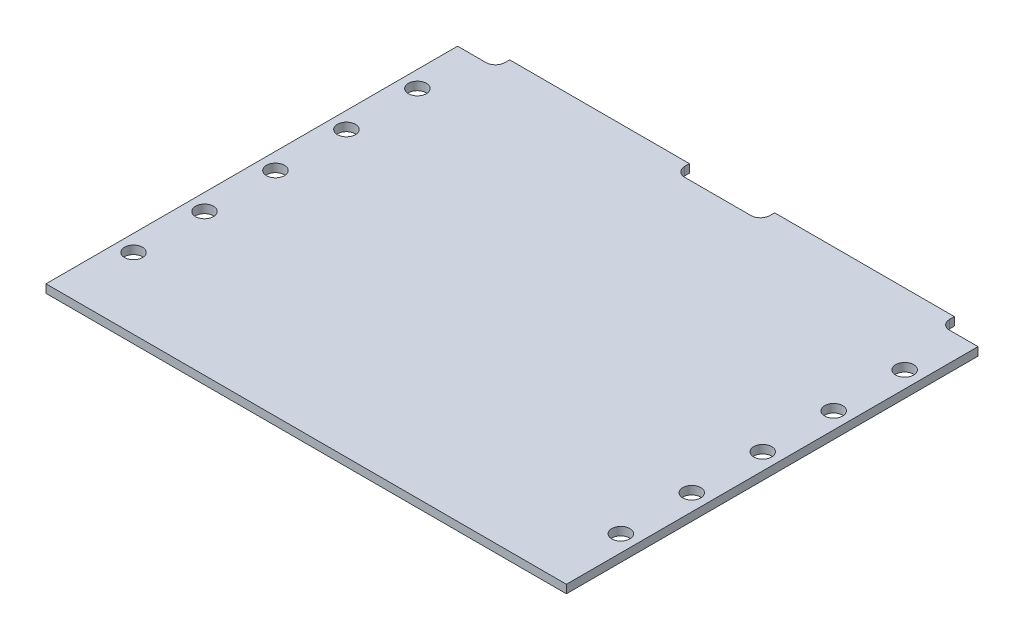
ISO-10303-21;
HEADER;
FILE_DESCRIPTION(('STEP AP214'),'2;1');
FILE_NAME('part.step','',(''),(''),'','','');
FILE_SCHEMA(('AUTOMOTIVE_DESIGN { 1 0 10303 214 1 1 1 1 }'));
ENDSEC;
DATA;
#1=APPLICATION_CONTEXT('core data for automotive mechanical design processes');
#2=APPLICATION_PROTOCOL_DEFINITION('international standard','automotive_design',2000,#1);
#3=PRODUCT_CONTEXT('',#1,'mechanical');
#4=PRODUCT('Part','Part','',(#3));
#5=PRODUCT_RELATED_PRODUCT_CATEGORY('part','',(#4));
#6=PRODUCT_DEFINITION_FORMATION('','',#4);
#7=PRODUCT_DEFINITION_CONTEXT('part definition',#1,'design');
#8=PRODUCT_DEFINITION('design','',#6,#7);
#9=PRODUCT_DEFINITION_SHAPE('','',#8);
#10=(LENGTH_UNIT() NAMED_UNIT(*) SI_UNIT(.MILLI.,.METRE.));
#11=(NAMED_UNIT(*) PLANE_ANGLE_UNIT() SI_UNIT($,.RADIAN.));
#12=(NAMED_UNIT(*) SI_UNIT($,.STERADIAN.) SOLID_ANGLE_UNIT());
#13=UNCERTAINTY_MEASURE_WITH_UNIT(LENGTH_MEASURE(1.E-05),#10,'distance_accuracy_value','');
#14=(GEOMETRIC_REPRESENTATION_CONTEXT(3) GLOBAL_UNCERTAINTY_ASSIGNED_CONTEXT((#13)) GLOBAL_UNIT_ASSIGNED_CONTEXT((#10,
#11,#12)) REPRESENTATION_CONTEXT('',''));
#15=CARTESIAN_POINT('',(0.,0.,0.));
#16=DIRECTION('',(0.,0.,1.));
#17=DIRECTION('',(1.,0.,0.));
#18=AXIS2_PLACEMENT_3D('',#15,#16,#17);
#19=CARTESIAN_POINT('',(0.,1.7526,-87.));
#20=DIRECTION('',(0.,0.,1.));
#21=DIRECTION('',(1.,0.,0.));
#22=AXIS2_PLACEMENT_3D('',#19,#20,#21);
#23=PLANE('',#22);
#24=DIRECTION('',(-1.,0.,0.));
#25=VECTOR('',#24,1.);
#26=CARTESIAN_POINT('',(0.,0.,-87.));
#27=LINE('',#26,#25);
#28=CARTESIAN_POINT('',(5.99999999999999,0.,-87.));
#29=VERTEX_POINT('',#28);
#30=CARTESIAN_POINT('',(0.,0.,-87.));
#31=VERTEX_POINT('',#30);
#32=EDGE_CURVE('E176',#29,#31,#27,.T.);
#33=ORIENTED_EDGE('',*,*,#32,.T.);
#34=DIRECTION('',(0.,-1.,0.));
#35=VECTOR('',#34,1.);
#36=CARTESIAN_POINT('',(0.,1.7526,-87.));
#37=LINE('',#36,#35);
#38=CARTESIAN_POINT('',(0.,1.7526,-87.));
#39=VERTEX_POINT('',#38);
#40=EDGE_CURVE('E11',#39,#31,#37,.T.);
#41=ORIENTED_EDGE('',*,*,#40,.F.);
#42=DIRECTION('',(-1.,0.,0.));
#43=VECTOR('',#42,1.);
#44=CARTESIAN_POINT('',(0.,1.7526,-87.));
#45=LINE('',#44,#43);
#46=CARTESIAN_POINT('',(5.99999999999999,1.7526,-87.));
#47=VERTEX_POINT('',#46);
#48=EDGE_CURVE('E207',#47,#39,#45,.T.);
#49=ORIENTED_EDGE('',*,*,#48,.F.);
#50=DIRECTION('',(0.,-1.,0.));
#51=VECTOR('',#50,1.);
#52=CARTESIAN_POINT('',(5.99999999999999,1.7526,-87.));
#53=LINE('',#52,#51);
#54=EDGE_CURVE('E172',#47,#29,#53,.T.);
#55=ORIENTED_EDGE('',*,*,#54,.T.);
#56=EDGE_LOOP('',(#33,#41,#49,#55));
#57=FACE_BOUND('',#56,.T.);
#58=ADVANCED_FACE('F32',(#57),#23,.F.);
#59=CARTESIAN_POINT('',(0.,1.7526,0.));
#60=DIRECTION('',(1.,0.,0.));
#61=DIRECTION('',(0.,0.,-1.));
#62=AXIS2_PLACEMENT_3D('',#59,#60,#61);
#63=PLANE('',#62);
#64=DIRECTION('',(0.,0.,1.));
#65=VECTOR('',#64,1.);
#66=CARTESIAN_POINT('',(0.,0.,0.));
#67=LINE('',#66,#65);
#68=CARTESIAN_POINT('',(0.,0.,0.));
#69=VERTEX_POINT('',#68);
#70=EDGE_CURVE('E179',#31,#69,#67,.T.);
#71=ORIENTED_EDGE('',*,*,#70,.T.);
#72=DIRECTION('',(0.,-1.,0.));
#73=VECTOR('',#72,1.);
#74=CARTESIAN_POINT('',(0.,1.7526,0.));
#75=LINE('',#74,#73);
#76=CARTESIAN_POINT('',(0.,1.7526,0.));
#77=VERTEX_POINT('',#76);
#78=EDGE_CURVE('E40',#77,#69,#75,.T.);
#79=ORIENTED_EDGE('',*,*,#78,.F.);
#80=DIRECTION('',(0.,0.,1.));
#81=VECTOR('',#80,1.);
#82=CARTESIAN_POINT('',(0.,1.7526,0.));
#83=LINE('',#82,#81);
#84=EDGE_CURVE('E115',#39,#77,#83,.T.);
#85=ORIENTED_EDGE('',*,*,#84,.F.);
#86=ORIENTED_EDGE('',*,*,#40,.T.);
#87=EDGE_LOOP('',(#71,#79,#85,#86));
#88=FACE_BOUND('',#87,.T.);
#89=ADVANCED_FACE('F306',(#88),#63,.F.);
#90=CARTESIAN_POINT('',(0.,1.7526,0.));
#91=DIRECTION('',(0.,0.,-1.));
#92=DIRECTION('',(-1.,0.,0.));
#93=AXIS2_PLACEMENT_3D('',#90,#91,#92);
#94=PLANE('',#93);
#95=DIRECTION('',(1.,0.,0.));
#96=VECTOR('',#95,1.);
#97=CARTESIAN_POINT('',(0.,0.,0.));
#98=LINE('',#97,#96);
#99=CARTESIAN_POINT('',(110.,0.,0.));
#100=VERTEX_POINT('',#99);
#101=EDGE_CURVE('E182',#69,#100,#98,.T.);
#102=ORIENTED_EDGE('',*,*,#101,.T.);
#103=DIRECTION('',(0.,-1.,0.));
#104=VECTOR('',#103,1.);
#105=CARTESIAN_POINT('',(110.,1.7526,0.));
#106=LINE('',#105,#104);
#107=CARTESIAN_POINT('',(110.,1.7526,0.));
#108=VERTEX_POINT('',#107);
#109=EDGE_CURVE('E238',#108,#100,#106,.T.);
#110=ORIENTED_EDGE('',*,*,#109,.F.);
#111=DIRECTION('',(1.,0.,0.));
#112=VECTOR('',#111,1.);
#113=CARTESIAN_POINT('',(0.,1.7526,0.));
#114=LINE('',#113,#112);
#115=EDGE_CURVE('E246',#77,#108,#114,.T.);
#116=ORIENTED_EDGE('',*,*,#115,.F.);
#117=ORIENTED_EDGE('',*,*,#78,.T.);
#118=EDGE_LOOP('',(#102,#110,#116,#117));
#119=FACE_BOUND('',#118,.T.);
#120=ADVANCED_FACE('F244',(#119),#94,.F.);
#121=CARTESIAN_POINT('',(110.,1.7526,0.));
#122=DIRECTION('',(-1.,0.,0.));
#123=DIRECTION('',(0.,0.,1.));
#124=AXIS2_PLACEMENT_3D('',#121,#122,#123);
#125=PLANE('',#124);
#126=DIRECTION('',(0.,0.,-1.));
#127=VECTOR('',#126,1.);
#128=CARTESIAN_POINT('',(110.,0.,0.));
#129=LINE('',#128,#127);
#130=CARTESIAN_POINT('',(110.,0.,-87.));
#131=VERTEX_POINT('',#130);
#132=EDGE_CURVE('E184',#100,#131,#129,.T.);
#133=ORIENTED_EDGE('',*,*,#132,.T.);
#134=DIRECTION('',(0.,-1.,0.));
#135=VECTOR('',#134,1.);
#136=CARTESIAN_POINT('',(110.,1.7526,-87.));
#137=LINE('',#136,#135);
#138=CARTESIAN_POINT('',(110.,1.7526,-87.));
#139=VERTEX_POINT('',#138);
#140=EDGE_CURVE('E235',#139,#131,#137,.T.);
#141=ORIENTED_EDGE('',*,*,#140,.F.);
#142=DIRECTION('',(0.,0.,-1.));
#143=VECTOR('',#142,1.);
#144=CARTESIAN_POINT('',(110.,1.7526,0.));
#145=LINE('',#144,#143);
#146=EDGE_CURVE('E264',#108,#139,#145,.T.);
#147=ORIENTED_EDGE('',*,*,#146,.F.);
#148=ORIENTED_EDGE('',*,*,#109,.T.);
#149=EDGE_LOOP('',(#133,#141,#147,#148));
#150=FACE_BOUND('',#149,.T.);
#151=ADVANCED_FACE('F255',(#150),#125,.F.);
#152=CARTESIAN_POINT('',(104.,1.7526,-87.));
#153=DIRECTION('',(0.,0.,1.));
#154=DIRECTION('',(1.,0.,0.));
#155=AXIS2_PLACEMENT_3D('',#152,#153,#154);
#156=PLANE('',#155);
#157=DIRECTION('',(-1.,0.,0.));
#158=VECTOR('',#157,1.);
#159=CARTESIAN_POINT('',(104.,0.,-87.));
#160=LINE('',#159,#158);
#161=CARTESIAN_POINT('',(104.,0.,-87.));
#162=VERTEX_POINT('',#161);
#163=EDGE_CURVE('E186',#131,#162,#160,.T.);
#164=ORIENTED_EDGE('',*,*,#163,.T.);
#165=DIRECTION('',(0.,-1.,0.));
#166=VECTOR('',#165,1.);
#167=CARTESIAN_POINT('',(104.,1.7526,-87.));
#168=LINE('',#167,#166);
#169=CARTESIAN_POINT('',(104.,1.7526,-87.));
#170=VERTEX_POINT('',#169);
#171=EDGE_CURVE('E232',#170,#162,#168,.T.);
#172=ORIENTED_EDGE('',*,*,#171,.F.);
#173=DIRECTION('',(-1.,0.,0.));
#174=VECTOR('',#173,1.);
#175=CARTESIAN_POINT('',(104.,1.7526,-87.));
#176=LINE('',#175,#174);
#177=EDGE_CURVE('E261',#139,#170,#176,.T.);
#178=ORIENTED_EDGE('',*,*,#177,.F.);
#179=ORIENTED_EDGE('',*,*,#140,.T.);
#180=EDGE_LOOP('',(#164,#172,#178,#179));
#181=FACE_BOUND('',#180,.T.);
#182=ADVANCED_FACE('F259',(#181),#156,.F.);
#183=CARTESIAN_POINT('',(104.,1.7526,-89.));
#184=DIRECTION('',(0.,-1.,0.));
#185=DIRECTION('',(0.,0.,-1.));
#186=AXIS2_PLACEMENT_3D('',#183,#184,#185);
#187=CYLINDRICAL_SURFACE('',#186,1.99999999999999);
#188=CARTESIAN_POINT('',(104.,0.,-89.));
#189=DIRECTION('',(0.,-1.,0.));
#190=DIRECTION('',(0.,0.,1.));
#191=AXIS2_PLACEMENT_3D('',#188,#189,#190);
#192=CIRCLE('',#191,1.99999999999999);
#193=CARTESIAN_POINT('',(102.,0.,-89.));
#194=VERTEX_POINT('',#193);
#195=EDGE_CURVE('E188',#162,#194,#192,.T.);
#196=ORIENTED_EDGE('',*,*,#195,.T.);
#197=DIRECTION('',(0.,-1.,0.));
#198=VECTOR('',#197,1.);
#199=CARTESIAN_POINT('',(102.,1.7526,-89.));
#200=LINE('',#199,#198);
#201=CARTESIAN_POINT('',(102.,1.7526,-89.));
#202=VERTEX_POINT('',#201);
#203=EDGE_CURVE('E229',#202,#194,#200,.T.);
#204=ORIENTED_EDGE('',*,*,#203,.F.);
#205=CARTESIAN_POINT('',(104.,1.7526,-89.));
#206=DIRECTION('',(0.,-1.,0.));
#207=DIRECTION('',(0.,0.,1.));
#208=AXIS2_PLACEMENT_3D('',#205,#206,#207);
#209=CIRCLE('',#208,1.99999999999999);
#210=EDGE_CURVE('E263',#170,#202,#209,.T.);
#211=ORIENTED_EDGE('',*,*,#210,.F.);
#212=ORIENTED_EDGE('',*,*,#171,.T.);
#213=EDGE_LOOP('',(#196,#204,#211,#212));
#214=FACE_BOUND('',#213,.T.);
#215=ADVANCED_FACE('F319',(#214),#187,.F.);
#216=CARTESIAN_POINT('',(102.,1.7526,-90.));
#217=DIRECTION('',(-1.,0.,0.));
#218=DIRECTION('',(0.,0.,1.));
#219=AXIS2_PLACEMENT_3D('',#216,#217,#218);
#220=PLANE('',#219);
#221=DIRECTION('',(0.,0.,-1.));
#222=VECTOR('',#221,1.);
#223=CARTESIAN_POINT('',(102.,0.,-90.));
#224=LINE('',#223,#222);
#225=CARTESIAN_POINT('',(102.,0.,-90.));
#226=VERTEX_POINT('',#225);
#227=EDGE_CURVE('E190',#194,#226,#224,.T.);
#228=ORIENTED_EDGE('',*,*,#227,.T.);
#229=DIRECTION('',(0.,-1.,0.));
#230=VECTOR('',#229,1.);
#231=CARTESIAN_POINT('',(102.,1.7526,-90.));
#232=LINE('',#231,#230);
#233=CARTESIAN_POINT('',(102.,1.7526,-90.));
#234=VERTEX_POINT('',#233);
#235=EDGE_CURVE('E226',#234,#226,#232,.T.);
#236=ORIENTED_EDGE('',*,*,#235,.F.);
#237=DIRECTION('',(0.,0.,-1.));
#238=VECTOR('',#237,1.);
#239=CARTESIAN_POINT('',(102.,1.7526,-90.));
#240=LINE('',#239,#238);
#241=EDGE_CURVE('E266',#202,#234,#240,.T.);
#242=ORIENTED_EDGE('',*,*,#241,.F.);
#243=ORIENTED_EDGE('',*,*,#203,.T.);
#244=EDGE_LOOP('',(#228,#236,#242,#243));
#245=FACE_BOUND('',#244,.T.);
#246=ADVANCED_FACE('F322',(#245),#220,.F.);
#247=CARTESIAN_POINT('',(102.,1.7526,-90.));
#248=DIRECTION('',(0.,0.,1.));
#249=DIRECTION('',(1.,0.,0.));
#250=AXIS2_PLACEMENT_3D('',#247,#248,#249);
#251=PLANE('',#250);
#252=DIRECTION('',(-1.,0.,0.));
#253=VECTOR('',#252,1.);
#254=CARTESIAN_POINT('',(102.,0.,-90.));
#255=LINE('',#254,#253);
#256=CARTESIAN_POINT('',(64.,0.,-90.));
#257=VERTEX_POINT('',#256);
#258=EDGE_CURVE('E192',#226,#257,#255,.T.);
#259=ORIENTED_EDGE('',*,*,#258,.T.);
#260=DIRECTION('',(0.,-1.,0.));
#261=VECTOR('',#260,1.);
#262=CARTESIAN_POINT('',(64.,1.7526,-90.));
#263=LINE('',#262,#261);
#264=CARTESIAN_POINT('',(64.,1.7526,-90.));
#265=VERTEX_POINT('',#264);
#266=EDGE_CURVE('E223',#265,#257,#263,.T.);
#267=ORIENTED_EDGE('',*,*,#266,.F.);
#268=DIRECTION('',(-1.,0.,0.));
#269=VECTOR('',#268,1.);
#270=CARTESIAN_POINT('',(102.,1.7526,-90.));
#271=LINE('',#270,#269);
#272=EDGE_CURVE('E272',#234,#265,#271,.T.);
#273=ORIENTED_EDGE('',*,*,#272,.F.);
#274=ORIENTED_EDGE('',*,*,#235,.T.);
#275=EDGE_LOOP('',(#259,#267,#273,#274));
#276=FACE_BOUND('',#275,.T.);
#277=ADVANCED_FACE('F326',(#276),#251,.F.);
#278=CARTESIAN_POINT('',(64.,1.7526,-90.));
#279=DIRECTION('',(1.,0.,0.));
#280=DIRECTION('',(0.,0.,-1.));
#281=AXIS2_PLACEMENT_3D('',#278,#279,#280);
#282=PLANE('',#281);
#283=DIRECTION('',(0.,0.,1.));
#284=VECTOR('',#283,1.);
#285=CARTESIAN_POINT('',(64.,0.,-90.));
#286=LINE('',#285,#284);
#287=CARTESIAN_POINT('',(64.,0.,-89.));
#288=VERTEX_POINT('',#287);
#289=EDGE_CURVE('E194',#257,#288,#286,.T.);
#290=ORIENTED_EDGE('',*,*,#289,.T.);
#291=DIRECTION('',(0.,-1.,0.));
#292=VECTOR('',#291,1.);
#293=CARTESIAN_POINT('',(64.,1.7526,-89.));
#294=LINE('',#293,#292);
#295=CARTESIAN_POINT('',(64.,1.7526,-89.));
#296=VERTEX_POINT('',#295);
#297=EDGE_CURVE('E220',#296,#288,#294,.T.);
#298=ORIENTED_EDGE('',*,*,#297,.F.);
#299=DIRECTION('',(0.,0.,1.));
#300=VECTOR('',#299,1.);
#301=CARTESIAN_POINT('',(64.,1.7526,-90.));
#302=LINE('',#301,#300);
#303=EDGE_CURVE('E274',#265,#296,#302,.T.);
#304=ORIENTED_EDGE('',*,*,#303,.F.);
#305=ORIENTED_EDGE('',*,*,#266,.T.);
#306=EDGE_LOOP('',(#290,#298,#304,#305));
#307=FACE_BOUND('',#306,.T.);
#308=ADVANCED_FACE('F330',(#307),#282,.F.);
#309=CARTESIAN_POINT('',(62.,1.7526,-89.));
#310=DIRECTION('',(0.,-1.,0.));
#311=DIRECTION('',(0.,0.,-1.));
#312=AXIS2_PLACEMENT_3D('',#309,#310,#311);
#313=CYLINDRICAL_SURFACE('',#312,1.99999999999997);
#314=CARTESIAN_POINT('',(62.,0.,-89.));
#315=DIRECTION('',(0.,-1.,0.));
#316=DIRECTION('',(0.,0.,-1.));
#317=AXIS2_PLACEMENT_3D('',#314,#315,#316);
#318=CIRCLE('',#317,1.99999999999997);
#319=CARTESIAN_POINT('',(62.,0.,-87.));
#320=VERTEX_POINT('',#319);
#321=EDGE_CURVE('E196',#288,#320,#318,.T.);
#322=ORIENTED_EDGE('',*,*,#321,.T.);
#323=DIRECTION('',(0.,-1.,0.));
#324=VECTOR('',#323,1.);
#325=CARTESIAN_POINT('',(62.,1.7526,-87.));
#326=LINE('',#325,#324);
#327=CARTESIAN_POINT('',(62.,1.7526,-87.));
#328=VERTEX_POINT('',#327);
#329=EDGE_CURVE('E217',#328,#320,#326,.T.);
#330=ORIENTED_EDGE('',*,*,#329,.F.);
#331=CARTESIAN_POINT('',(62.,1.7526,-89.));
#332=DIRECTION('',(0.,-1.,0.));
#333=DIRECTION('',(0.,0.,-1.));
#334=AXIS2_PLACEMENT_3D('',#331,#332,#333);
#335=CIRCLE('',#334,1.99999999999997);
#336=EDGE_CURVE('E276',#296,#328,#335,.T.);
#337=ORIENTED_EDGE('',*,*,#336,.F.);
#338=ORIENTED_EDGE('',*,*,#297,.T.);
#339=EDGE_LOOP('',(#322,#330,#337,#338));
#340=FACE_BOUND('',#339,.T.);
#341=ADVANCED_FACE('F334',(#340),#313,.F.);
#342=CARTESIAN_POINT('',(48.,1.7526,-87.));
#343=DIRECTION('',(0.,0.,1.));
#344=DIRECTION('',(1.,0.,0.));
#345=AXIS2_PLACEMENT_3D('',#342,#343,#344);
#346=PLANE('',#345);
#347=DIRECTION('',(-1.,0.,0.));
#348=VECTOR('',#347,1.);
#349=CARTESIAN_POINT('',(48.,0.,-87.));
#350=LINE('',#349,#348);
#351=CARTESIAN_POINT('',(48.,0.,-87.));
#352=VERTEX_POINT('',#351);
#353=EDGE_CURVE('E198',#320,#352,#350,.T.);
#354=ORIENTED_EDGE('',*,*,#353,.T.);
#355=DIRECTION('',(0.,-1.,0.));
#356=VECTOR('',#355,1.);
#357=CARTESIAN_POINT('',(48.,1.7526,-87.));
#358=LINE('',#357,#356);
#359=CARTESIAN_POINT('',(48.,1.7526,-87.));
#360=VERTEX_POINT('',#359);
#361=EDGE_CURVE('E214',#360,#352,#358,.T.);
#362=ORIENTED_EDGE('',*,*,#361,.F.);
#363=DIRECTION('',(-1.,0.,0.));
#364=VECTOR('',#363,1.);
#365=CARTESIAN_POINT('',(48.,1.7526,-87.));
#366=LINE('',#365,#364);
#367=EDGE_CURVE('E278',#328,#360,#366,.T.);
#368=ORIENTED_EDGE('',*,*,#367,.F.);
#369=ORIENTED_EDGE('',*,*,#329,.T.);
#370=EDGE_LOOP('',(#354,#362,#368,#369));
#371=FACE_BOUND('',#370,.T.);
#372=ADVANCED_FACE('F338',(#371),#346,.F.);
#373=CARTESIAN_POINT('',(48.,1.7526,-89.));
#374=DIRECTION('',(0.,-1.,0.));
#375=DIRECTION('',(0.,0.,-1.));
#376=AXIS2_PLACEMENT_3D('',#373,#374,#375);
#377=CYLINDRICAL_SURFACE('',#376,2.00000000000001);
#378=CARTESIAN_POINT('',(48.,0.,-89.));
#379=DIRECTION('',(0.,-1.,0.));
#380=DIRECTION('',(0.,0.,1.));
#381=AXIS2_PLACEMENT_3D('',#378,#379,#380);
#382=CIRCLE('',#381,2.00000000000001);
#383=CARTESIAN_POINT('',(46.,0.,-89.));
#384=VERTEX_POINT('',#383);
#385=EDGE_CURVE('E200',#352,#384,#382,.T.);
#386=ORIENTED_EDGE('',*,*,#385,.T.);
#387=DIRECTION('',(0.,-1.,0.));
#388=VECTOR('',#387,1.);
#389=CARTESIAN_POINT('',(46.,1.7526,-89.));
#390=LINE('',#389,#388);
#391=CARTESIAN_POINT('',(46.,1.7526,-89.));
#392=VERTEX_POINT('',#391);
#393=EDGE_CURVE('E211',#392,#384,#390,.T.);
#394=ORIENTED_EDGE('',*,*,#393,.F.);
#395=CARTESIAN_POINT('',(48.,1.7526,-89.));
#396=DIRECTION('',(0.,-1.,0.));
#397=DIRECTION('',(0.,0.,1.));
#398=AXIS2_PLACEMENT_3D('',#395,#396,#397);
#399=CIRCLE('',#398,2.00000000000001);
#400=EDGE_CURVE('E280',#360,#392,#399,.T.);
#401=ORIENTED_EDGE('',*,*,#400,.F.);
#402=ORIENTED_EDGE('',*,*,#361,.T.);
#403=EDGE_LOOP('',(#386,#394,#401,#402));
#404=FACE_BOUND('',#403,.T.);
#405=ADVANCED_FACE('F286',(#404),#377,.F.);
#406=CARTESIAN_POINT('',(46.,1.7526,-90.));
#407=DIRECTION('',(-1.,0.,0.));
#408=DIRECTION('',(0.,0.,1.));
#409=AXIS2_PLACEMENT_3D('',#406,#407,#408);
#410=PLANE('',#409);
#411=DIRECTION('',(0.,0.,-1.));
#412=VECTOR('',#411,1.);
#413=CARTESIAN_POINT('',(46.,0.,-90.));
#414=LINE('',#413,#412);
#415=CARTESIAN_POINT('',(46.,0.,-90.));
#416=VERTEX_POINT('',#415);
#417=EDGE_CURVE('E202',#384,#416,#414,.T.);
#418=ORIENTED_EDGE('',*,*,#417,.T.);
#419=DIRECTION('',(0.,-1.,0.));
#420=VECTOR('',#419,1.);
#421=CARTESIAN_POINT('',(46.,1.7526,-90.));
#422=LINE('',#421,#420);
#423=CARTESIAN_POINT('',(46.,1.7526,-90.));
#424=VERTEX_POINT('',#423);
#425=EDGE_CURVE('E167',#424,#416,#422,.T.);
#426=ORIENTED_EDGE('',*,*,#425,.F.);
#427=DIRECTION('',(0.,0.,-1.));
#428=VECTOR('',#427,1.);
#429=CARTESIAN_POINT('',(46.,1.7526,-90.));
#430=LINE('',#429,#428);
#431=EDGE_CURVE('E158',#392,#424,#430,.T.);
#432=ORIENTED_EDGE('',*,*,#431,.F.);
#433=ORIENTED_EDGE('',*,*,#393,.T.);
#434=EDGE_LOOP('',(#418,#426,#432,#433));
#435=FACE_BOUND('',#434,.T.);
#436=ADVANCED_FACE('F290',(#435),#410,.F.);
#437=CARTESIAN_POINT('',(7.99999999999998,1.7526,-90.));
#438=DIRECTION('',(0.,0.,1.));
#439=DIRECTION('',(1.,0.,0.));
#440=AXIS2_PLACEMENT_3D('',#437,#438,#439);
#441=PLANE('',#440);
#442=DIRECTION('',(-1.,0.,0.));
#443=VECTOR('',#442,1.);
#444=CARTESIAN_POINT('',(7.99999999999998,0.,-90.));
#445=LINE('',#444,#443);
#446=CARTESIAN_POINT('',(7.99999999999998,0.,-90.));
#447=VERTEX_POINT('',#446);
#448=EDGE_CURVE('E166',#416,#447,#445,.T.);
#449=ORIENTED_EDGE('',*,*,#448,.T.);
#450=DIRECTION('',(0.,-1.,0.));
#451=VECTOR('',#450,1.);
#452=CARTESIAN_POINT('',(7.99999999999998,1.7526,-90.));
#453=LINE('',#452,#451);
#454=CARTESIAN_POINT('',(7.99999999999998,1.7526,-90.));
#455=VERTEX_POINT('',#454);
#456=EDGE_CURVE('E163',#455,#447,#453,.T.);
#457=ORIENTED_EDGE('',*,*,#456,.F.);
#458=DIRECTION('',(-1.,0.,0.));
#459=VECTOR('',#458,1.);
#460=CARTESIAN_POINT('',(7.99999999999998,1.7526,-90.));
#461=LINE('',#460,#459);
#462=EDGE_CURVE('E152',#424,#455,#461,.T.);
#463=ORIENTED_EDGE('',*,*,#462,.F.);
#464=ORIENTED_EDGE('',*,*,#425,.T.);
#465=EDGE_LOOP('',(#449,#457,#463,#464));
#466=FACE_BOUND('',#465,.T.);
#467=ADVANCED_FACE('F164',(#466),#441,.F.);
#468=CARTESIAN_POINT('',(7.99999999999998,1.7526,-90.));
#469=DIRECTION('',(1.,0.,0.));
#470=DIRECTION('',(0.,0.,-1.));
#471=AXIS2_PLACEMENT_3D('',#468,#469,#470);
#472=PLANE('',#471);
#473=DIRECTION('',(0.,0.,1.));
#474=VECTOR('',#473,1.);
#475=CARTESIAN_POINT('',(7.99999999999998,0.,-90.));
#476=LINE('',#475,#474);
#477=CARTESIAN_POINT('',(7.99999999999998,0.,-89.));
#478=VERTEX_POINT('',#477);
#479=EDGE_CURVE('E101',#447,#478,#476,.T.);
#480=ORIENTED_EDGE('',*,*,#479,.T.);
#481=DIRECTION('',(0.,-1.,0.));
#482=VECTOR('',#481,1.);
#483=CARTESIAN_POINT('',(7.99999999999998,1.7526,-89.));
#484=LINE('',#483,#482);
#485=CARTESIAN_POINT('',(7.99999999999998,1.7526,-89.));
#486=VERTEX_POINT('',#485);
#487=EDGE_CURVE('E168',#486,#478,#484,.T.);
#488=ORIENTED_EDGE('',*,*,#487,.F.);
#489=DIRECTION('',(0.,0.,1.));
#490=VECTOR('',#489,1.);
#491=CARTESIAN_POINT('',(7.99999999999998,1.7526,-90.));
#492=LINE('',#491,#490);
#493=EDGE_CURVE('E156',#455,#486,#492,.T.);
#494=ORIENTED_EDGE('',*,*,#493,.F.);
#495=ORIENTED_EDGE('',*,*,#456,.T.);
#496=EDGE_LOOP('',(#480,#488,#494,#495));
#497=FACE_BOUND('',#496,.T.);
#498=ADVANCED_FACE('F170',(#497),#472,.F.);
#499=CARTESIAN_POINT('',(6.,1.7526,-89.));
#500=DIRECTION('',(0.,-1.,0.));
#501=DIRECTION('',(0.,0.,-1.));
#502=AXIS2_PLACEMENT_3D('',#499,#500,#501);
#503=CYLINDRICAL_SURFACE('',#502,1.99999999999998);
#504=CARTESIAN_POINT('',(6.,0.,-89.));
#505=DIRECTION('',(0.,-1.,0.));
#506=DIRECTION('',(0.,0.,-1.));
#507=AXIS2_PLACEMENT_3D('',#504,#505,#506);
#508=CIRCLE('',#507,1.99999999999998);
#509=EDGE_CURVE('E107',#478,#29,#508,.T.);
#510=ORIENTED_EDGE('',*,*,#509,.T.);
#511=ORIENTED_EDGE('',*,*,#54,.F.);
#512=CARTESIAN_POINT('',(6.,1.7526,-89.));
#513=DIRECTION('',(0.,-1.,0.));
#514=DIRECTION('',(0.,0.,-1.));
#515=AXIS2_PLACEMENT_3D('',#512,#513,#514);
#516=CIRCLE('',#515,1.99999999999998);
#517=EDGE_CURVE('E48',#486,#47,#516,.T.);
#518=ORIENTED_EDGE('',*,*,#517,.F.);
#519=ORIENTED_EDGE('',*,*,#487,.T.);
#520=EDGE_LOOP('',(#510,#511,#518,#519));
#521=FACE_BOUND('',#520,.T.);
#522=ADVANCED_FACE('F294',(#521),#503,.F.);
#523=CARTESIAN_POINT('',(6.,1.7526,-89.));
#524=DIRECTION('',(0.,-1.,0.));
#525=DIRECTION('',(0.,0.,-1.));
#526=AXIS2_PLACEMENT_3D('',#523,#524,#525);
#527=PLANE('',#526);
#528=CARTESIAN_POINT('',(3.49999999999979,1.7526,-75.));
#529=DIRECTION('',(0.,1.,0.));
#530=DIRECTION('',(0.,0.,1.));
#531=AXIS2_PLACEMENT_3D('',#528,#529,#530);
#532=CIRCLE('',#531,1.905);
#533=CARTESIAN_POINT('',(3.49999999999979,1.7526,-73.095));
#534=VERTEX_POINT('',#533);
#535=EDGE_CURVE('E484',#534,#534,#532,.T.);
#536=ORIENTED_EDGE('',*,*,#535,.F.);
#537=EDGE_LOOP('',(#536));
#538=FACE_BOUND('',#537,.T.);
#539=CARTESIAN_POINT('',(3.49999999999984,1.7526,-60.));
#540=DIRECTION('',(0.,1.,0.));
#541=DIRECTION('',(0.,0.,1.));
#542=AXIS2_PLACEMENT_3D('',#539,#540,#541);
#543=CIRCLE('',#542,1.905);
#544=CARTESIAN_POINT('',(3.49999999999984,1.7526,-58.095));
#545=VERTEX_POINT('',#544);
#546=EDGE_CURVE('E486',#545,#545,#543,.T.);
#547=ORIENTED_EDGE('',*,*,#546,.F.);
#548=EDGE_LOOP('',(#547));
#549=FACE_BOUND('',#548,.T.);
#550=CARTESIAN_POINT('',(3.4999999999999,1.7526,-45.));
#551=DIRECTION('',(0.,1.,0.));
#552=DIRECTION('',(0.,0.,1.));
#553=AXIS2_PLACEMENT_3D('',#550,#551,#552);
#554=CIRCLE('',#553,1.905);
#555=CARTESIAN_POINT('',(3.4999999999999,1.7526,-43.095));
#556=VERTEX_POINT('',#555);
#557=EDGE_CURVE('E492',#556,#556,#554,.T.);
#558=ORIENTED_EDGE('',*,*,#557,.F.);
#559=EDGE_LOOP('',(#558));
#560=FACE_BOUND('',#559,.T.);
#561=CARTESIAN_POINT('',(3.49999999999995,1.7526,-30.));
#562=DIRECTION('',(0.,1.,0.));
#563=DIRECTION('',(0.,0.,1.));
#564=AXIS2_PLACEMENT_3D('',#561,#562,#563);
#565=CIRCLE('',#564,1.905);
#566=CARTESIAN_POINT('',(3.49999999999995,1.7526,-28.095));
#567=VERTEX_POINT('',#566);
#568=EDGE_CURVE('E498',#567,#567,#565,.T.);
#569=ORIENTED_EDGE('',*,*,#568,.F.);
#570=EDGE_LOOP('',(#569));
#571=FACE_BOUND('',#570,.T.);
#572=CARTESIAN_POINT('',(106.5,1.7526,-75.));
#573=DIRECTION('',(0.,1.,0.));
#574=DIRECTION('',(0.,0.,1.));
#575=AXIS2_PLACEMENT_3D('',#572,#573,#574);
#576=CIRCLE('',#575,1.905);
#577=CARTESIAN_POINT('',(106.5,1.7526,-73.095));
#578=VERTEX_POINT('',#577);
#579=EDGE_CURVE('E504',#578,#578,#576,.T.);
#580=ORIENTED_EDGE('',*,*,#579,.F.);
#581=EDGE_LOOP('',(#580));
#582=FACE_BOUND('',#581,.T.);
#583=CARTESIAN_POINT('',(106.5,1.7526,-60.));
#584=DIRECTION('',(0.,1.,0.));
#585=DIRECTION('',(0.,0.,1.));
#586=AXIS2_PLACEMENT_3D('',#583,#584,#585);
#587=CIRCLE('',#586,1.90499999999999);
#588=CARTESIAN_POINT('',(106.5,1.7526,-58.095));
#589=VERTEX_POINT('',#588);
#590=EDGE_CURVE('E510',#589,#589,#587,.T.);
#591=ORIENTED_EDGE('',*,*,#590,.F.);
#592=EDGE_LOOP('',(#591));
#593=FACE_BOUND('',#592,.T.);
#594=CARTESIAN_POINT('',(106.5,1.7526,-45.));
#595=DIRECTION('',(0.,1.,0.));
#596=DIRECTION('',(0.,0.,1.));
#597=AXIS2_PLACEMENT_3D('',#594,#595,#596);
#598=CIRCLE('',#597,1.90499999999999);
#599=CARTESIAN_POINT('',(106.5,1.7526,-43.095));
#600=VERTEX_POINT('',#599);
#601=EDGE_CURVE('E516',#600,#600,#598,.T.);
#602=ORIENTED_EDGE('',*,*,#601,.F.);
#603=EDGE_LOOP('',(#602));
#604=FACE_BOUND('',#603,.T.);
#605=CARTESIAN_POINT('',(106.5,1.7526,-30.));
#606=DIRECTION('',(0.,1.,0.));
#607=DIRECTION('',(0.,0.,1.));
#608=AXIS2_PLACEMENT_3D('',#605,#606,#607);
#609=CIRCLE('',#608,1.90499999999999);
#610=CARTESIAN_POINT('',(106.5,1.7526,-28.095));
#611=VERTEX_POINT('',#610);
#612=EDGE_CURVE('E522',#611,#611,#609,.T.);
#613=ORIENTED_EDGE('',*,*,#612,.F.);
#614=EDGE_LOOP('',(#613));
#615=FACE_BOUND('',#614,.T.);
#616=CARTESIAN_POINT('',(106.5,1.7526,-15.));
#617=DIRECTION('',(0.,1.,0.));
#618=DIRECTION('',(0.,0.,1.));
#619=AXIS2_PLACEMENT_3D('',#616,#617,#618);
#620=CIRCLE('',#619,1.90499999999999);
#621=CARTESIAN_POINT('',(106.5,1.7526,-13.095));
#622=VERTEX_POINT('',#621);
#623=EDGE_CURVE('E528',#622,#622,#620,.T.);
#624=ORIENTED_EDGE('',*,*,#623,.F.);
#625=EDGE_LOOP('',(#624));
#626=FACE_BOUND('',#625,.T.);
#627=CARTESIAN_POINT('',(3.5,1.7526,-15.));
#628=DIRECTION('',(0.,1.,0.));
#629=DIRECTION('',(0.,0.,1.));
#630=AXIS2_PLACEMENT_3D('',#627,#628,#629);
#631=CIRCLE('',#630,1.905);
#632=CARTESIAN_POINT('',(3.5,1.7526,-13.095));
#633=VERTEX_POINT('',#632);
#634=EDGE_CURVE('E534',#633,#633,#631,.T.);
#635=ORIENTED_EDGE('',*,*,#634,.F.);
#636=EDGE_LOOP('',(#635));
#637=FACE_BOUND('',#636,.T.);
#638=ORIENTED_EDGE('',*,*,#48,.T.);
#639=ORIENTED_EDGE('',*,*,#84,.T.);
#640=ORIENTED_EDGE('',*,*,#115,.T.);
#641=ORIENTED_EDGE('',*,*,#146,.T.);
#642=ORIENTED_EDGE('',*,*,#177,.T.);
#643=ORIENTED_EDGE('',*,*,#210,.T.);
#644=ORIENTED_EDGE('',*,*,#241,.T.);
#645=ORIENTED_EDGE('',*,*,#272,.T.);
#646=ORIENTED_EDGE('',*,*,#303,.T.);
#647=ORIENTED_EDGE('',*,*,#336,.T.);
#648=ORIENTED_EDGE('',*,*,#367,.T.);
#649=ORIENTED_EDGE('',*,*,#400,.T.);
#650=ORIENTED_EDGE('',*,*,#431,.T.);
#651=ORIENTED_EDGE('',*,*,#462,.T.);
#652=ORIENTED_EDGE('',*,*,#493,.T.);
#653=ORIENTED_EDGE('',*,*,#517,.T.);
#654=EDGE_LOOP('',(#638,#639,#640,#641,#642,#643,#644,#645,#646,#647,#648,#649,#650,#651,#652,#653));
#655=FACE_BOUND('',#654,.T.);
#656=ADVANCED_FACE('F154',(#538,#549,#560,#571,#582,#593,#604,#615,#626,#637,#655),#527,.F.);
#657=CARTESIAN_POINT('',(6.,0.,-89.));
#658=DIRECTION('',(0.,-1.,0.));
#659=DIRECTION('',(0.,0.,-1.));
#660=AXIS2_PLACEMENT_3D('',#657,#658,#659);
#661=PLANE('',#660);
#662=CARTESIAN_POINT('',(3.49999999999979,0.,-75.));
#663=DIRECTION('',(0.,1.,0.));
#664=DIRECTION('',(0.,0.,1.));
#665=AXIS2_PLACEMENT_3D('',#662,#663,#664);
#666=CIRCLE('',#665,1.905);
#667=CARTESIAN_POINT('',(3.49999999999979,0.,-73.095));
#668=VERTEX_POINT('',#667);
#669=EDGE_CURVE('E481',#668,#668,#666,.T.);
#670=ORIENTED_EDGE('',*,*,#669,.T.);
#671=EDGE_LOOP('',(#670));
#672=FACE_BOUND('',#671,.T.);
#673=CARTESIAN_POINT('',(3.49999999999984,0.,-60.));
#674=DIRECTION('',(0.,1.,0.));
#675=DIRECTION('',(0.,0.,1.));
#676=AXIS2_PLACEMENT_3D('',#673,#674,#675);
#677=CIRCLE('',#676,1.905);
#678=CARTESIAN_POINT('',(3.49999999999984,0.,-58.095));
#679=VERTEX_POINT('',#678);
#680=EDGE_CURVE('E489',#679,#679,#677,.T.);
#681=ORIENTED_EDGE('',*,*,#680,.T.);
#682=EDGE_LOOP('',(#681));
#683=FACE_BOUND('',#682,.T.);
#684=CARTESIAN_POINT('',(3.4999999999999,0.,-45.));
#685=DIRECTION('',(0.,1.,0.));
#686=DIRECTION('',(0.,0.,1.));
#687=AXIS2_PLACEMENT_3D('',#684,#685,#686);
#688=CIRCLE('',#687,1.905);
#689=CARTESIAN_POINT('',(3.4999999999999,0.,-43.095));
#690=VERTEX_POINT('',#689);
#691=EDGE_CURVE('E495',#690,#690,#688,.T.);
#692=ORIENTED_EDGE('',*,*,#691,.T.);
#693=EDGE_LOOP('',(#692));
#694=FACE_BOUND('',#693,.T.);
#695=CARTESIAN_POINT('',(3.49999999999995,0.,-30.));
#696=DIRECTION('',(0.,1.,0.));
#697=DIRECTION('',(0.,0.,1.));
#698=AXIS2_PLACEMENT_3D('',#695,#696,#697);
#699=CIRCLE('',#698,1.905);
#700=CARTESIAN_POINT('',(3.49999999999995,0.,-28.095));
#701=VERTEX_POINT('',#700);
#702=EDGE_CURVE('E501',#701,#701,#699,.T.);
#703=ORIENTED_EDGE('',*,*,#702,.T.);
#704=EDGE_LOOP('',(#703));
#705=FACE_BOUND('',#704,.T.);
#706=CARTESIAN_POINT('',(106.5,0.,-75.));
#707=DIRECTION('',(0.,1.,0.));
#708=DIRECTION('',(0.,0.,1.));
#709=AXIS2_PLACEMENT_3D('',#706,#707,#708);
#710=CIRCLE('',#709,1.905);
#711=CARTESIAN_POINT('',(106.5,0.,-73.095));
#712=VERTEX_POINT('',#711);
#713=EDGE_CURVE('E507',#712,#712,#710,.T.);
#714=ORIENTED_EDGE('',*,*,#713,.T.);
#715=EDGE_LOOP('',(#714));
#716=FACE_BOUND('',#715,.T.);
#717=CARTESIAN_POINT('',(106.5,0.,-60.));
#718=DIRECTION('',(0.,1.,0.));
#719=DIRECTION('',(0.,0.,1.));
#720=AXIS2_PLACEMENT_3D('',#717,#718,#719);
#721=CIRCLE('',#720,1.90499999999999);
#722=CARTESIAN_POINT('',(106.5,0.,-58.095));
#723=VERTEX_POINT('',#722);
#724=EDGE_CURVE('E513',#723,#723,#721,.T.);
#725=ORIENTED_EDGE('',*,*,#724,.T.);
#726=EDGE_LOOP('',(#725));
#727=FACE_BOUND('',#726,.T.);
#728=CARTESIAN_POINT('',(106.5,0.,-45.));
#729=DIRECTION('',(0.,1.,0.));
#730=DIRECTION('',(0.,0.,1.));
#731=AXIS2_PLACEMENT_3D('',#728,#729,#730);
#732=CIRCLE('',#731,1.90499999999999);
#733=CARTESIAN_POINT('',(106.5,0.,-43.095));
#734=VERTEX_POINT('',#733);
#735=EDGE_CURVE('E519',#734,#734,#732,.T.);
#736=ORIENTED_EDGE('',*,*,#735,.T.);
#737=EDGE_LOOP('',(#736));
#738=FACE_BOUND('',#737,.T.);
#739=CARTESIAN_POINT('',(106.5,0.,-30.));
#740=DIRECTION('',(0.,1.,0.));
#741=DIRECTION('',(0.,0.,1.));
#742=AXIS2_PLACEMENT_3D('',#739,#740,#741);
#743=CIRCLE('',#742,1.90499999999999);
#744=CARTESIAN_POINT('',(106.5,0.,-28.095));
#745=VERTEX_POINT('',#744);
#746=EDGE_CURVE('E525',#745,#745,#743,.T.);
#747=ORIENTED_EDGE('',*,*,#746,.T.);
#748=EDGE_LOOP('',(#747));
#749=FACE_BOUND('',#748,.T.);
#750=CARTESIAN_POINT('',(106.5,0.,-15.));
#751=DIRECTION('',(0.,1.,0.));
#752=DIRECTION('',(0.,0.,1.));
#753=AXIS2_PLACEMENT_3D('',#750,#751,#752);
#754=CIRCLE('',#753,1.90499999999999);
#755=CARTESIAN_POINT('',(106.5,0.,-13.095));
#756=VERTEX_POINT('',#755);
#757=EDGE_CURVE('E531',#756,#756,#754,.T.);
#758=ORIENTED_EDGE('',*,*,#757,.T.);
#759=EDGE_LOOP('',(#758));
#760=FACE_BOUND('',#759,.T.);
#761=CARTESIAN_POINT('',(3.5,0.,-15.));
#762=DIRECTION('',(0.,1.,0.));
#763=DIRECTION('',(0.,0.,1.));
#764=AXIS2_PLACEMENT_3D('',#761,#762,#763);
#765=CIRCLE('',#764,1.905);
#766=CARTESIAN_POINT('',(3.5,0.,-13.095));
#767=VERTEX_POINT('',#766);
#768=EDGE_CURVE('E180',#767,#767,#765,.T.);
#769=ORIENTED_EDGE('',*,*,#768,.T.);
#770=EDGE_LOOP('',(#769));
#771=FACE_BOUND('',#770,.T.);
#772=ORIENTED_EDGE('',*,*,#32,.F.);
#773=ORIENTED_EDGE('',*,*,#509,.F.);
#774=ORIENTED_EDGE('',*,*,#479,.F.);
#775=ORIENTED_EDGE('',*,*,#448,.F.);
#776=ORIENTED_EDGE('',*,*,#417,.F.);
#777=ORIENTED_EDGE('',*,*,#385,.F.);
#778=ORIENTED_EDGE('',*,*,#353,.F.);
#779=ORIENTED_EDGE('',*,*,#321,.F.);
#780=ORIENTED_EDGE('',*,*,#289,.F.);
#781=ORIENTED_EDGE('',*,*,#258,.F.);
#782=ORIENTED_EDGE('',*,*,#227,.F.);
#783=ORIENTED_EDGE('',*,*,#195,.F.);
#784=ORIENTED_EDGE('',*,*,#163,.F.);
#785=ORIENTED_EDGE('',*,*,#132,.F.);
#786=ORIENTED_EDGE('',*,*,#101,.F.);
#787=ORIENTED_EDGE('',*,*,#70,.F.);
#788=EDGE_LOOP('',(#772,#773,#774,#775,#776,#777,#778,#779,#780,#781,#782,#783,#784,#785,#786,#787));
#789=FACE_BOUND('',#788,.T.);
#790=ADVANCED_FACE('F250',(#672,#683,#694,#705,#716,#727,#738,#749,#760,#771,#789),#661,.T.);
#791=CARTESIAN_POINT('',(3.5,0.,-15.));
#792=DIRECTION('',(0.,1.,0.));
#793=DIRECTION('',(0.,0.,1.));
#794=AXIS2_PLACEMENT_3D('',#791,#792,#793);
#795=CYLINDRICAL_SURFACE('',#794,1.905);
#796=ORIENTED_EDGE('',*,*,#768,.F.);
#797=EDGE_LOOP('',(#796));
#798=FACE_BOUND('',#797,.T.);
#799=ORIENTED_EDGE('',*,*,#634,.T.);
#800=EDGE_LOOP('',(#799));
#801=FACE_BOUND('',#800,.T.);
#802=ADVANCED_FACE('F375',(#798,#801),#795,.F.);
#803=CARTESIAN_POINT('',(106.5,0.,-15.));
#804=DIRECTION('',(0.,1.,0.));
#805=DIRECTION('',(0.,0.,1.));
#806=AXIS2_PLACEMENT_3D('',#803,#804,#805);
#807=CYLINDRICAL_SURFACE('',#806,1.90499999999999);
#808=ORIENTED_EDGE('',*,*,#757,.F.);
#809=EDGE_LOOP('',(#808));
#810=FACE_BOUND('',#809,.T.);
#811=ORIENTED_EDGE('',*,*,#623,.T.);
#812=EDGE_LOOP('',(#811));
#813=FACE_BOUND('',#812,.T.);
#814=ADVANCED_FACE('F384',(#810,#813),#807,.F.);
#815=CARTESIAN_POINT('',(106.5,0.,-30.));
#816=DIRECTION('',(0.,1.,0.));
#817=DIRECTION('',(0.,0.,1.));
#818=AXIS2_PLACEMENT_3D('',#815,#816,#817);
#819=CYLINDRICAL_SURFACE('',#818,1.90499999999999);
#820=ORIENTED_EDGE('',*,*,#746,.F.);
#821=EDGE_LOOP('',(#820));
#822=FACE_BOUND('',#821,.T.);
#823=ORIENTED_EDGE('',*,*,#612,.T.);
#824=EDGE_LOOP('',(#823));
#825=FACE_BOUND('',#824,.T.);
#826=ADVANCED_FACE('F394',(#822,#825),#819,.F.);
#827=CARTESIAN_POINT('',(106.5,0.,-45.));
#828=DIRECTION('',(0.,1.,0.));
#829=DIRECTION('',(0.,0.,1.));
#830=AXIS2_PLACEMENT_3D('',#827,#828,#829);
#831=CYLINDRICAL_SURFACE('',#830,1.90499999999999);
#832=ORIENTED_EDGE('',*,*,#735,.F.);
#833=EDGE_LOOP('',(#832));
#834=FACE_BOUND('',#833,.T.);
#835=ORIENTED_EDGE('',*,*,#601,.T.);
#836=EDGE_LOOP('',(#835));
#837=FACE_BOUND('',#836,.T.);
#838=ADVANCED_FACE('F404',(#834,#837),#831,.F.);
#839=CARTESIAN_POINT('',(106.5,0.,-60.));
#840=DIRECTION('',(0.,1.,0.));
#841=DIRECTION('',(0.,0.,1.));
#842=AXIS2_PLACEMENT_3D('',#839,#840,#841);
#843=CYLINDRICAL_SURFACE('',#842,1.90499999999999);
#844=ORIENTED_EDGE('',*,*,#724,.F.);
#845=EDGE_LOOP('',(#844));
#846=FACE_BOUND('',#845,.T.);
#847=ORIENTED_EDGE('',*,*,#590,.T.);
#848=EDGE_LOOP('',(#847));
#849=FACE_BOUND('',#848,.T.);
#850=ADVANCED_FACE('F414',(#846,#849),#843,.F.);
#851=CARTESIAN_POINT('',(106.5,0.,-75.));
#852=DIRECTION('',(0.,1.,0.));
#853=DIRECTION('',(0.,0.,1.));
#854=AXIS2_PLACEMENT_3D('',#851,#852,#853);
#855=CYLINDRICAL_SURFACE('',#854,1.905);
#856=ORIENTED_EDGE('',*,*,#713,.F.);
#857=EDGE_LOOP('',(#856));
#858=FACE_BOUND('',#857,.T.);
#859=ORIENTED_EDGE('',*,*,#579,.T.);
#860=EDGE_LOOP('',(#859));
#861=FACE_BOUND('',#860,.T.);
#862=ADVANCED_FACE('F424',(#858,#861),#855,.F.);
#863=CARTESIAN_POINT('',(3.49999999999995,0.,-30.));
#864=DIRECTION('',(0.,1.,0.));
#865=DIRECTION('',(0.,0.,1.));
#866=AXIS2_PLACEMENT_3D('',#863,#864,#865);
#867=CYLINDRICAL_SURFACE('',#866,1.905);
#868=ORIENTED_EDGE('',*,*,#702,.F.);
#869=EDGE_LOOP('',(#868));
#870=FACE_BOUND('',#869,.T.);
#871=ORIENTED_EDGE('',*,*,#568,.T.);
#872=EDGE_LOOP('',(#871));
#873=FACE_BOUND('',#872,.T.);
#874=ADVANCED_FACE('F434',(#870,#873),#867,.F.);
#875=CARTESIAN_POINT('',(3.4999999999999,0.,-45.));
#876=DIRECTION('',(0.,1.,0.));
#877=DIRECTION('',(0.,0.,1.));
#878=AXIS2_PLACEMENT_3D('',#875,#876,#877);
#879=CYLINDRICAL_SURFACE('',#878,1.905);
#880=ORIENTED_EDGE('',*,*,#691,.F.);
#881=EDGE_LOOP('',(#880));
#882=FACE_BOUND('',#881,.T.);
#883=ORIENTED_EDGE('',*,*,#557,.T.);
#884=EDGE_LOOP('',(#883));
#885=FACE_BOUND('',#884,.T.);
#886=ADVANCED_FACE('F444',(#882,#885),#879,.F.);
#887=CARTESIAN_POINT('',(3.49999999999984,0.,-60.));
#888=DIRECTION('',(0.,1.,0.));
#889=DIRECTION('',(0.,0.,1.));
#890=AXIS2_PLACEMENT_3D('',#887,#888,#889);
#891=CYLINDRICAL_SURFACE('',#890,1.905);
#892=ORIENTED_EDGE('',*,*,#680,.F.);
#893=EDGE_LOOP('',(#892));
#894=FACE_BOUND('',#893,.T.);
#895=ORIENTED_EDGE('',*,*,#546,.T.);
#896=EDGE_LOOP('',(#895));
#897=FACE_BOUND('',#896,.T.);
#898=ADVANCED_FACE('F454',(#894,#897),#891,.F.);
#899=CARTESIAN_POINT('',(3.49999999999979,0.,-75.));
#900=DIRECTION('',(0.,1.,0.));
#901=DIRECTION('',(0.,0.,1.));
#902=AXIS2_PLACEMENT_3D('',#899,#900,#901);
#903=CYLINDRICAL_SURFACE('',#902,1.905);
#904=ORIENTED_EDGE('',*,*,#669,.F.);
#905=EDGE_LOOP('',(#904));
#906=FACE_BOUND('',#905,.T.);
#907=ORIENTED_EDGE('',*,*,#535,.T.);
#908=EDGE_LOOP('',(#907));
#909=FACE_BOUND('',#908,.T.);
#910=ADVANCED_FACE('F464',(#906,#909),#903,.F.);
#911=CLOSED_SHELL('',(#58,#89,#120,#151,#182,#215,#246,#277,#308,#341,#372,#405,#436,#467,#498,
#522,#656,#790,#802,#814,#826,#838,#850,#862,#874,#886,#898,#910));
#912=MANIFOLD_SOLID_BREP('B2',#911);
#913=ADVANCED_BREP_SHAPE_REPRESENTATION('',(#18,#912),#14);
#914=SHAPE_DEFINITION_REPRESENTATION(#9,#913);
ENDSEC;
END-ISO-10303-21;
